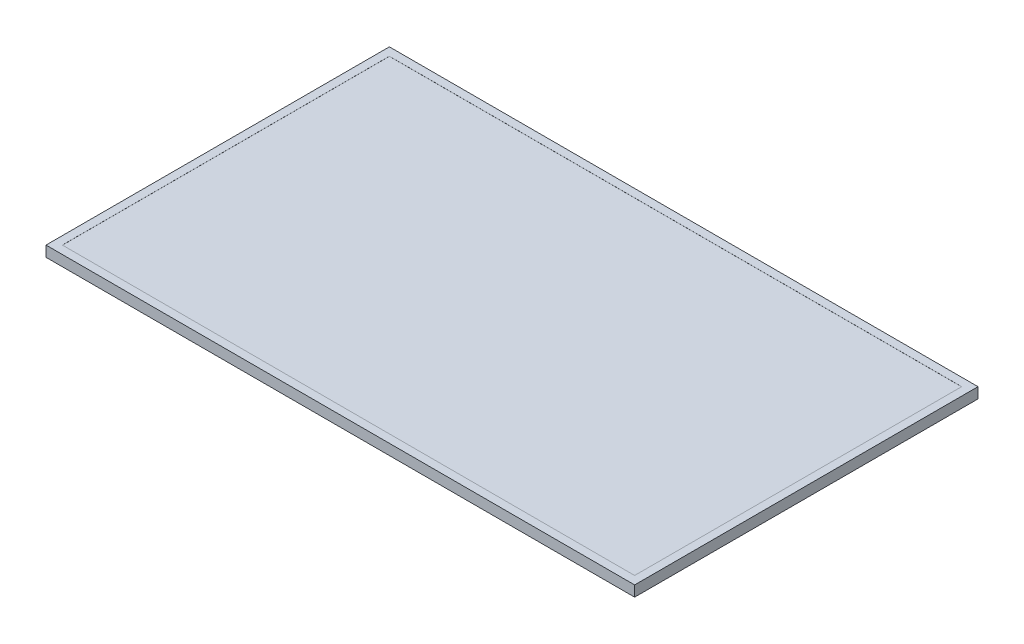
ISO-10303-21;
HEADER;
FILE_DESCRIPTION(('STEP AP214'),'2;1');
FILE_NAME('part.step','',(''),(''),'','','');
FILE_SCHEMA(('AUTOMOTIVE_DESIGN { 1 0 10303 214 1 1 1 1 }'));
ENDSEC;
DATA;
#1=APPLICATION_CONTEXT('core data for automotive mechanical design processes');
#2=APPLICATION_PROTOCOL_DEFINITION('international standard','automotive_design',2000,#1);
#3=PRODUCT_CONTEXT('',#1,'mechanical');
#4=PRODUCT('Part','Part','',(#3));
#5=PRODUCT_RELATED_PRODUCT_CATEGORY('part','',(#4));
#6=PRODUCT_DEFINITION_FORMATION('','',#4);
#7=PRODUCT_DEFINITION_CONTEXT('part definition',#1,'design');
#8=PRODUCT_DEFINITION('design','',#6,#7);
#9=PRODUCT_DEFINITION_SHAPE('','',#8);
#10=(LENGTH_UNIT() NAMED_UNIT(*) SI_UNIT(.MILLI.,.METRE.));
#11=(NAMED_UNIT(*) PLANE_ANGLE_UNIT() SI_UNIT($,.RADIAN.));
#12=(NAMED_UNIT(*) SI_UNIT($,.STERADIAN.) SOLID_ANGLE_UNIT());
#13=UNCERTAINTY_MEASURE_WITH_UNIT(LENGTH_MEASURE(1.E-05),#10,'distance_accuracy_value','');
#14=(GEOMETRIC_REPRESENTATION_CONTEXT(3) GLOBAL_UNCERTAINTY_ASSIGNED_CONTEXT((#13)) GLOBAL_UNIT_ASSIGNED_CONTEXT((#10,
#11,#12)) REPRESENTATION_CONTEXT('',''));
#15=CARTESIAN_POINT('',(0.,0.,0.));
#16=DIRECTION('',(0.,0.,1.));
#17=DIRECTION('',(1.,0.,0.));
#18=AXIS2_PLACEMENT_3D('',#15,#16,#17);
#19=CARTESIAN_POINT('',(0.,6.45,0.));
#20=DIRECTION('',(0.,1.,0.));
#21=DIRECTION('',(0.,0.,1.));
#22=AXIS2_PLACEMENT_3D('',#19,#20,#21);
#23=PLANE('',#22);
#24=DIRECTION('',(1.,0.,0.));
#25=VECTOR('',#24,1.);
#26=CARTESIAN_POINT('',(0.,6.45,100.));
#27=LINE('',#26,#25);
#28=CARTESIAN_POINT('',(-175.,6.45,100.));
#29=VERTEX_POINT('',#28);
#30=CARTESIAN_POINT('',(175.,6.45,100.));
#31=VERTEX_POINT('',#30);
#32=EDGE_CURVE('E210',#29,#31,#27,.T.);
#33=ORIENTED_EDGE('',*,*,#32,.T.);
#34=DIRECTION('',(0.,0.,-1.));
#35=VECTOR('',#34,1.);
#36=CARTESIAN_POINT('',(175.,6.45,0.));
#37=LINE('',#36,#35);
#38=CARTESIAN_POINT('',(175.,6.45,-100.));
#39=VERTEX_POINT('',#38);
#40=EDGE_CURVE('E222',#31,#39,#37,.T.);
#41=ORIENTED_EDGE('',*,*,#40,.T.);
#42=DIRECTION('',(1.,0.,0.));
#43=VECTOR('',#42,1.);
#44=CARTESIAN_POINT('',(0.,6.45,-100.));
#45=LINE('',#44,#43);
#46=CARTESIAN_POINT('',(-175.,6.45,-100.));
#47=VERTEX_POINT('',#46);
#48=EDGE_CURVE('E48',#47,#39,#45,.T.);
#49=ORIENTED_EDGE('',*,*,#48,.F.);
#50=DIRECTION('',(0.,0.,-1.));
#51=VECTOR('',#50,1.);
#52=CARTESIAN_POINT('',(-175.,6.45,0.));
#53=LINE('',#52,#51);
#54=EDGE_CURVE('E11',#29,#47,#53,.T.);
#55=ORIENTED_EDGE('',*,*,#54,.F.);
#56=EDGE_LOOP('',(#33,#41,#49,#55));
#57=FACE_BOUND('',#56,.T.);
#58=ADVANCED_FACE('F40',(#57),#23,.T.);
#59=CARTESIAN_POINT('',(0.,6.5,105.));
#60=DIRECTION('',(0.,0.,-1.));
#61=DIRECTION('',(-1.,0.,0.));
#62=AXIS2_PLACEMENT_3D('',#59,#60,#61);
#63=PLANE('',#62);
#64=DIRECTION('',(1.,0.,0.));
#65=VECTOR('',#64,1.);
#66=CARTESIAN_POINT('',(0.,0.,105.));
#67=LINE('',#66,#65);
#68=CARTESIAN_POINT('',(-180.,0.,105.));
#69=VERTEX_POINT('',#68);
#70=CARTESIAN_POINT('',(180.,0.,105.));
#71=VERTEX_POINT('',#70);
#72=EDGE_CURVE('E163',#69,#71,#67,.T.);
#73=ORIENTED_EDGE('',*,*,#72,.T.);
#74=DIRECTION('',(0.,-1.,0.));
#75=VECTOR('',#74,1.);
#76=CARTESIAN_POINT('',(180.,6.5,105.));
#77=LINE('',#76,#75);
#78=CARTESIAN_POINT('',(180.,6.5,105.));
#79=VERTEX_POINT('',#78);
#80=EDGE_CURVE('E207',#79,#71,#77,.T.);
#81=ORIENTED_EDGE('',*,*,#80,.F.);
#82=DIRECTION('',(1.,0.,0.));
#83=VECTOR('',#82,1.);
#84=CARTESIAN_POINT('',(0.,6.5,105.));
#85=LINE('',#84,#83);
#86=CARTESIAN_POINT('',(-180.,6.5,105.));
#87=VERTEX_POINT('',#86);
#88=EDGE_CURVE('E178',#87,#79,#85,.T.);
#89=ORIENTED_EDGE('',*,*,#88,.F.);
#90=DIRECTION('',(0.,-1.,0.));
#91=VECTOR('',#90,1.);
#92=CARTESIAN_POINT('',(-180.,6.5,105.));
#93=LINE('',#92,#91);
#94=EDGE_CURVE('E200',#87,#69,#93,.T.);
#95=ORIENTED_EDGE('',*,*,#94,.T.);
#96=EDGE_LOOP('',(#73,#81,#89,#95));
#97=FACE_BOUND('',#96,.T.);
#98=ADVANCED_FACE('F252',(#97),#63,.F.);
#99=CARTESIAN_POINT('',(180.,6.5,0.));
#100=DIRECTION('',(-1.,0.,0.));
#101=DIRECTION('',(0.,0.,1.));
#102=AXIS2_PLACEMENT_3D('',#99,#100,#101);
#103=PLANE('',#102);
#104=DIRECTION('',(0.,0.,-1.));
#105=VECTOR('',#104,1.);
#106=CARTESIAN_POINT('',(180.,0.,0.));
#107=LINE('',#106,#105);
#108=CARTESIAN_POINT('',(180.,0.,-105.));
#109=VERTEX_POINT('',#108);
#110=EDGE_CURVE('E192',#71,#109,#107,.T.);
#111=ORIENTED_EDGE('',*,*,#110,.T.);
#112=DIRECTION('',(0.,-1.,0.));
#113=VECTOR('',#112,1.);
#114=CARTESIAN_POINT('',(180.,6.5,-105.));
#115=LINE('',#114,#113);
#116=CARTESIAN_POINT('',(180.,6.5,-105.));
#117=VERTEX_POINT('',#116);
#118=EDGE_CURVE('E205',#117,#109,#115,.T.);
#119=ORIENTED_EDGE('',*,*,#118,.F.);
#120=DIRECTION('',(0.,0.,-1.));
#121=VECTOR('',#120,1.);
#122=CARTESIAN_POINT('',(180.,6.5,0.));
#123=LINE('',#122,#121);
#124=EDGE_CURVE('E181',#79,#117,#123,.T.);
#125=ORIENTED_EDGE('',*,*,#124,.F.);
#126=ORIENTED_EDGE('',*,*,#80,.T.);
#127=EDGE_LOOP('',(#111,#119,#125,#126));
#128=FACE_BOUND('',#127,.T.);
#129=ADVANCED_FACE('F257',(#128),#103,.F.);
#130=CARTESIAN_POINT('',(0.,6.5,-105.));
#131=DIRECTION('',(0.,0.,-1.));
#132=DIRECTION('',(-1.,0.,0.));
#133=AXIS2_PLACEMENT_3D('',#130,#131,#132);
#134=PLANE('',#133);
#135=DIRECTION('',(1.,0.,0.));
#136=VECTOR('',#135,1.);
#137=CARTESIAN_POINT('',(0.,0.,-105.));
#138=LINE('',#137,#136);
#139=CARTESIAN_POINT('',(-180.,0.,-105.));
#140=VERTEX_POINT('',#139);
#141=EDGE_CURVE('E195',#140,#109,#138,.T.);
#142=ORIENTED_EDGE('',*,*,#141,.F.);
#143=DIRECTION('',(0.,-1.,0.));
#144=VECTOR('',#143,1.);
#145=CARTESIAN_POINT('',(-180.,6.5,-105.));
#146=LINE('',#145,#144);
#147=CARTESIAN_POINT('',(-180.,6.5,-105.));
#148=VERTEX_POINT('',#147);
#149=EDGE_CURVE('E202',#148,#140,#146,.T.);
#150=ORIENTED_EDGE('',*,*,#149,.F.);
#151=DIRECTION('',(1.,0.,0.));
#152=VECTOR('',#151,1.);
#153=CARTESIAN_POINT('',(0.,6.5,-105.));
#154=LINE('',#153,#152);
#155=EDGE_CURVE('E183',#148,#117,#154,.T.);
#156=ORIENTED_EDGE('',*,*,#155,.T.);
#157=ORIENTED_EDGE('',*,*,#118,.T.);
#158=EDGE_LOOP('',(#142,#150,#156,#157));
#159=FACE_BOUND('',#158,.T.);
#160=ADVANCED_FACE('F262',(#159),#134,.T.);
#161=CARTESIAN_POINT('',(175.,6.5,0.));
#162=DIRECTION('',(-1.,0.,0.));
#163=DIRECTION('',(0.,0.,1.));
#164=AXIS2_PLACEMENT_3D('',#161,#162,#163);
#165=PLANE('',#164);
#166=DIRECTION('',(0.,-1.,0.));
#167=VECTOR('',#166,1.);
#168=CARTESIAN_POINT('',(175.,6.5,-100.));
#169=LINE('',#168,#167);
#170=CARTESIAN_POINT('',(175.,6.5,-100.));
#171=VERTEX_POINT('',#170);
#172=EDGE_CURVE('E189',#171,#39,#169,.T.);
#173=ORIENTED_EDGE('',*,*,#172,.T.);
#174=ORIENTED_EDGE('',*,*,#40,.F.);
#175=DIRECTION('',(0.,-1.,0.));
#176=VECTOR('',#175,1.);
#177=CARTESIAN_POINT('',(175.,6.5,100.));
#178=LINE('',#177,#176);
#179=CARTESIAN_POINT('',(175.,6.5,100.));
#180=VERTEX_POINT('',#179);
#181=EDGE_CURVE('E203',#180,#31,#178,.T.);
#182=ORIENTED_EDGE('',*,*,#181,.F.);
#183=DIRECTION('',(0.,0.,-1.));
#184=VECTOR('',#183,1.);
#185=CARTESIAN_POINT('',(175.,6.5,0.));
#186=LINE('',#185,#184);
#187=EDGE_CURVE('E167',#180,#171,#186,.T.);
#188=ORIENTED_EDGE('',*,*,#187,.T.);
#189=EDGE_LOOP('',(#173,#174,#182,#188));
#190=FACE_BOUND('',#189,.T.);
#191=ADVANCED_FACE('F231',(#190),#165,.T.);
#192=CARTESIAN_POINT('',(0.,6.5,100.));
#193=DIRECTION('',(0.,0.,-1.));
#194=DIRECTION('',(-1.,0.,0.));
#195=AXIS2_PLACEMENT_3D('',#192,#193,#194);
#196=PLANE('',#195);
#197=ORIENTED_EDGE('',*,*,#181,.T.);
#198=ORIENTED_EDGE('',*,*,#32,.F.);
#199=DIRECTION('',(0.,-1.,0.));
#200=VECTOR('',#199,1.);
#201=CARTESIAN_POINT('',(-175.,6.5,100.));
#202=LINE('',#201,#200);
#203=CARTESIAN_POINT('',(-175.,6.5,100.));
#204=VERTEX_POINT('',#203);
#205=EDGE_CURVE('E216',#204,#29,#202,.T.);
#206=ORIENTED_EDGE('',*,*,#205,.F.);
#207=DIRECTION('',(1.,0.,0.));
#208=VECTOR('',#207,1.);
#209=CARTESIAN_POINT('',(0.,6.5,100.));
#210=LINE('',#209,#208);
#211=EDGE_CURVE('E170',#204,#180,#210,.T.);
#212=ORIENTED_EDGE('',*,*,#211,.T.);
#213=EDGE_LOOP('',(#197,#198,#206,#212));
#214=FACE_BOUND('',#213,.T.);
#215=ADVANCED_FACE('F238',(#214),#196,.T.);
#216=CARTESIAN_POINT('',(-175.,6.5,0.));
#217=DIRECTION('',(-1.,0.,0.));
#218=DIRECTION('',(0.,0.,1.));
#219=AXIS2_PLACEMENT_3D('',#216,#217,#218);
#220=PLANE('',#219);
#221=ORIENTED_EDGE('',*,*,#54,.T.);
#222=DIRECTION('',(0.,-1.,0.));
#223=VECTOR('',#222,1.);
#224=CARTESIAN_POINT('',(-175.,6.5,-100.));
#225=LINE('',#224,#223);
#226=CARTESIAN_POINT('',(-175.,6.5,-100.));
#227=VERTEX_POINT('',#226);
#228=EDGE_CURVE('E213',#227,#47,#225,.T.);
#229=ORIENTED_EDGE('',*,*,#228,.F.);
#230=DIRECTION('',(0.,0.,-1.));
#231=VECTOR('',#230,1.);
#232=CARTESIAN_POINT('',(-175.,6.5,0.));
#233=LINE('',#232,#231);
#234=EDGE_CURVE('E174',#204,#227,#233,.T.);
#235=ORIENTED_EDGE('',*,*,#234,.F.);
#236=ORIENTED_EDGE('',*,*,#205,.T.);
#237=EDGE_LOOP('',(#221,#229,#235,#236));
#238=FACE_BOUND('',#237,.T.);
#239=ADVANCED_FACE('F241',(#238),#220,.F.);
#240=CARTESIAN_POINT('',(0.,6.5,-100.));
#241=DIRECTION('',(0.,0.,-1.));
#242=DIRECTION('',(-1.,0.,0.));
#243=AXIS2_PLACEMENT_3D('',#240,#241,#242);
#244=PLANE('',#243);
#245=ORIENTED_EDGE('',*,*,#48,.T.);
#246=ORIENTED_EDGE('',*,*,#172,.F.);
#247=DIRECTION('',(1.,0.,0.));
#248=VECTOR('',#247,1.);
#249=CARTESIAN_POINT('',(0.,6.5,-100.));
#250=LINE('',#249,#248);
#251=EDGE_CURVE('E176',#227,#171,#250,.T.);
#252=ORIENTED_EDGE('',*,*,#251,.F.);
#253=ORIENTED_EDGE('',*,*,#228,.T.);
#254=EDGE_LOOP('',(#245,#246,#252,#253));
#255=FACE_BOUND('',#254,.T.);
#256=ADVANCED_FACE('F226',(#255),#244,.F.);
#257=CARTESIAN_POINT('',(-180.,6.5,0.));
#258=DIRECTION('',(-1.,0.,0.));
#259=DIRECTION('',(0.,0.,1.));
#260=AXIS2_PLACEMENT_3D('',#257,#258,#259);
#261=PLANE('',#260);
#262=DIRECTION('',(0.,0.,-1.));
#263=VECTOR('',#262,1.);
#264=CARTESIAN_POINT('',(-180.,0.,0.));
#265=LINE('',#264,#263);
#266=EDGE_CURVE('E171',#69,#140,#265,.T.);
#267=ORIENTED_EDGE('',*,*,#266,.F.);
#268=ORIENTED_EDGE('',*,*,#94,.F.);
#269=DIRECTION('',(0.,0.,-1.));
#270=VECTOR('',#269,1.);
#271=CARTESIAN_POINT('',(-180.,6.5,0.));
#272=LINE('',#271,#270);
#273=EDGE_CURVE('E186',#87,#148,#272,.T.);
#274=ORIENTED_EDGE('',*,*,#273,.T.);
#275=ORIENTED_EDGE('',*,*,#149,.T.);
#276=EDGE_LOOP('',(#267,#268,#274,#275));
#277=FACE_BOUND('',#276,.T.);
#278=ADVANCED_FACE('F248',(#277),#261,.T.);
#279=CARTESIAN_POINT('',(0.,6.5,0.));
#280=DIRECTION('',(0.,1.,0.));
#281=DIRECTION('',(0.,0.,1.));
#282=AXIS2_PLACEMENT_3D('',#279,#280,#281);
#283=PLANE('',#282);
#284=ORIENTED_EDGE('',*,*,#187,.F.);
#285=ORIENTED_EDGE('',*,*,#211,.F.);
#286=ORIENTED_EDGE('',*,*,#234,.T.);
#287=ORIENTED_EDGE('',*,*,#251,.T.);
#288=EDGE_LOOP('',(#284,#285,#286,#287));
#289=FACE_BOUND('',#288,.T.);
#290=ORIENTED_EDGE('',*,*,#88,.T.);
#291=ORIENTED_EDGE('',*,*,#124,.T.);
#292=ORIENTED_EDGE('',*,*,#155,.F.);
#293=ORIENTED_EDGE('',*,*,#273,.F.);
#294=EDGE_LOOP('',(#290,#291,#292,#293));
#295=FACE_BOUND('',#294,.T.);
#296=ADVANCED_FACE('F235',(#289,#295),#283,.T.);
#297=CARTESIAN_POINT('',(0.,0.,0.));
#298=DIRECTION('',(0.,1.,0.));
#299=DIRECTION('',(0.,0.,1.));
#300=AXIS2_PLACEMENT_3D('',#297,#298,#299);
#301=PLANE('',#300);
#302=DIRECTION('',(0.,0.,-1.));
#303=VECTOR('',#302,1.);
#304=CARTESIAN_POINT('',(47.0000000000001,0.,0.));
#305=LINE('',#304,#303);
#306=CARTESIAN_POINT('',(47.0000000000001,0.,72.4));
#307=VERTEX_POINT('',#306);
#308=CARTESIAN_POINT('',(47.0000000000001,0.,65.4));
#309=VERTEX_POINT('',#308);
#310=EDGE_CURVE('E152',#307,#309,#305,.T.);
#311=ORIENTED_EDGE('',*,*,#310,.F.);
#312=DIRECTION('',(1.,0.,0.));
#313=VECTOR('',#312,1.);
#314=CARTESIAN_POINT('',(0.,0.,72.4));
#315=LINE('',#314,#313);
#316=CARTESIAN_POINT('',(75.0000000000001,0.,72.4));
#317=VERTEX_POINT('',#316);
#318=EDGE_CURVE('E158',#307,#317,#315,.T.);
#319=ORIENTED_EDGE('',*,*,#318,.T.);
#320=DIRECTION('',(0.,0.,-1.));
#321=VECTOR('',#320,1.);
#322=CARTESIAN_POINT('',(75.0000000000001,0.,0.));
#323=LINE('',#322,#321);
#324=CARTESIAN_POINT('',(75.0000000000001,0.,65.4));
#325=VERTEX_POINT('',#324);
#326=EDGE_CURVE('E134',#317,#325,#323,.T.);
#327=ORIENTED_EDGE('',*,*,#326,.T.);
#328=DIRECTION('',(1.,0.,0.));
#329=VECTOR('',#328,1.);
#330=CARTESIAN_POINT('',(0.,0.,65.4));
#331=LINE('',#330,#329);
#332=EDGE_CURVE('E55',#309,#325,#331,.T.);
#333=ORIENTED_EDGE('',*,*,#332,.F.);
#334=EDGE_LOOP('',(#311,#319,#327,#333));
#335=FACE_BOUND('',#334,.T.);
#336=ORIENTED_EDGE('',*,*,#72,.F.);
#337=ORIENTED_EDGE('',*,*,#266,.T.);
#338=ORIENTED_EDGE('',*,*,#141,.T.);
#339=ORIENTED_EDGE('',*,*,#110,.F.);
#340=EDGE_LOOP('',(#336,#337,#338,#339));
#341=FACE_BOUND('',#340,.T.);
#342=ADVANCED_FACE('F42',(#335,#341),#301,.F.);
#343=CARTESIAN_POINT('',(0.,-0.5,72.4));
#344=DIRECTION('',(0.,0.,1.));
#345=DIRECTION('',(1.,0.,0.));
#346=AXIS2_PLACEMENT_3D('',#343,#344,#345);
#347=PLANE('',#346);
#348=ORIENTED_EDGE('',*,*,#318,.F.);
#349=DIRECTION('',(0.,1.,0.));
#350=VECTOR('',#349,1.);
#351=CARTESIAN_POINT('',(47.0000000000001,-0.5,72.4));
#352=LINE('',#351,#350);
#353=CARTESIAN_POINT('',(47.0000000000001,-0.5,72.4));
#354=VERTEX_POINT('',#353);
#355=EDGE_CURVE('E150',#354,#307,#352,.T.);
#356=ORIENTED_EDGE('',*,*,#355,.F.);
#357=DIRECTION('',(1.,0.,0.));
#358=VECTOR('',#357,1.);
#359=CARTESIAN_POINT('',(0.,-0.5,72.4));
#360=LINE('',#359,#358);
#361=CARTESIAN_POINT('',(75.0000000000001,-0.5,72.4));
#362=VERTEX_POINT('',#361);
#363=EDGE_CURVE('E145',#354,#362,#360,.T.);
#364=ORIENTED_EDGE('',*,*,#363,.T.);
#365=DIRECTION('',(0.,1.,0.));
#366=VECTOR('',#365,1.);
#367=CARTESIAN_POINT('',(75.0000000000001,-0.5,72.4));
#368=LINE('',#367,#366);
#369=EDGE_CURVE('E129',#362,#317,#368,.T.);
#370=ORIENTED_EDGE('',*,*,#369,.T.);
#371=EDGE_LOOP('',(#348,#356,#364,#370));
#372=FACE_BOUND('',#371,.T.);
#373=ADVANCED_FACE('F149',(#372),#347,.T.);
#374=CARTESIAN_POINT('',(47.0000000000001,-0.5,0.));
#375=DIRECTION('',(1.,0.,0.));
#376=DIRECTION('',(0.,0.,-1.));
#377=AXIS2_PLACEMENT_3D('',#374,#375,#376);
#378=PLANE('',#377);
#379=ORIENTED_EDGE('',*,*,#310,.T.);
#380=DIRECTION('',(0.,1.,0.));
#381=VECTOR('',#380,1.);
#382=CARTESIAN_POINT('',(47.0000000000001,-0.5,65.4));
#383=LINE('',#382,#381);
#384=CARTESIAN_POINT('',(47.0000000000001,-0.5,65.4));
#385=VERTEX_POINT('',#384);
#386=EDGE_CURVE('E164',#385,#309,#383,.T.);
#387=ORIENTED_EDGE('',*,*,#386,.F.);
#388=DIRECTION('',(0.,0.,-1.));
#389=VECTOR('',#388,1.);
#390=CARTESIAN_POINT('',(47.0000000000001,-0.5,0.));
#391=LINE('',#390,#389);
#392=EDGE_CURVE('E140',#354,#385,#391,.T.);
#393=ORIENTED_EDGE('',*,*,#392,.F.);
#394=ORIENTED_EDGE('',*,*,#355,.T.);
#395=EDGE_LOOP('',(#379,#387,#393,#394));
#396=FACE_BOUND('',#395,.T.);
#397=ADVANCED_FACE('F282',(#396),#378,.F.);
#398=CARTESIAN_POINT('',(0.,-0.5,65.4));
#399=DIRECTION('',(0.,0.,1.));
#400=DIRECTION('',(1.,0.,0.));
#401=AXIS2_PLACEMENT_3D('',#398,#399,#400);
#402=PLANE('',#401);
#403=ORIENTED_EDGE('',*,*,#332,.T.);
#404=DIRECTION('',(0.,1.,0.));
#405=VECTOR('',#404,1.);
#406=CARTESIAN_POINT('',(75.0000000000001,-0.5,65.4));
#407=LINE('',#406,#405);
#408=CARTESIAN_POINT('',(75.0000000000001,-0.5,65.4));
#409=VERTEX_POINT('',#408);
#410=EDGE_CURVE('E139',#409,#325,#407,.T.);
#411=ORIENTED_EDGE('',*,*,#410,.F.);
#412=DIRECTION('',(1.,0.,0.));
#413=VECTOR('',#412,1.);
#414=CARTESIAN_POINT('',(0.,-0.5,65.4));
#415=LINE('',#414,#413);
#416=EDGE_CURVE('E147',#385,#409,#415,.T.);
#417=ORIENTED_EDGE('',*,*,#416,.F.);
#418=ORIENTED_EDGE('',*,*,#386,.T.);
#419=EDGE_LOOP('',(#403,#411,#417,#418));
#420=FACE_BOUND('',#419,.T.);
#421=ADVANCED_FACE('F285',(#420),#402,.F.);
#422=CARTESIAN_POINT('',(75.0000000000001,-0.5,0.));
#423=DIRECTION('',(1.,0.,0.));
#424=DIRECTION('',(0.,0.,-1.));
#425=AXIS2_PLACEMENT_3D('',#422,#423,#424);
#426=PLANE('',#425);
#427=ORIENTED_EDGE('',*,*,#326,.F.);
#428=ORIENTED_EDGE('',*,*,#369,.F.);
#429=DIRECTION('',(0.,0.,-1.));
#430=VECTOR('',#429,1.);
#431=CARTESIAN_POINT('',(75.0000000000001,-0.5,0.));
#432=LINE('',#431,#430);
#433=EDGE_CURVE('E132',#362,#409,#432,.T.);
#434=ORIENTED_EDGE('',*,*,#433,.T.);
#435=ORIENTED_EDGE('',*,*,#410,.T.);
#436=EDGE_LOOP('',(#427,#428,#434,#435));
#437=FACE_BOUND('',#436,.T.);
#438=ADVANCED_FACE('F131',(#437),#426,.T.);
#439=CARTESIAN_POINT('',(0.,-0.5,0.));
#440=DIRECTION('',(0.,1.,0.));
#441=DIRECTION('',(0.,0.,1.));
#442=AXIS2_PLACEMENT_3D('',#439,#440,#441);
#443=PLANE('',#442);
#444=ORIENTED_EDGE('',*,*,#363,.F.);
#445=ORIENTED_EDGE('',*,*,#392,.T.);
#446=ORIENTED_EDGE('',*,*,#416,.T.);
#447=ORIENTED_EDGE('',*,*,#433,.F.);
#448=EDGE_LOOP('',(#444,#445,#446,#447));
#449=FACE_BOUND('',#448,.T.);
#450=ADVANCED_FACE('F144',(#449),#443,.F.);
#451=CLOSED_SHELL('',(#58,#98,#129,#160,#191,#215,#239,#256,#278,#296,#342,#373,#397,#421,#438,#450));
#452=MANIFOLD_SOLID_BREP('B2',#451);
#453=ADVANCED_BREP_SHAPE_REPRESENTATION('',(#18,#452),#14);
#454=SHAPE_DEFINITION_REPRESENTATION(#9,#453);
ENDSEC;
END-ISO-10303-21;
